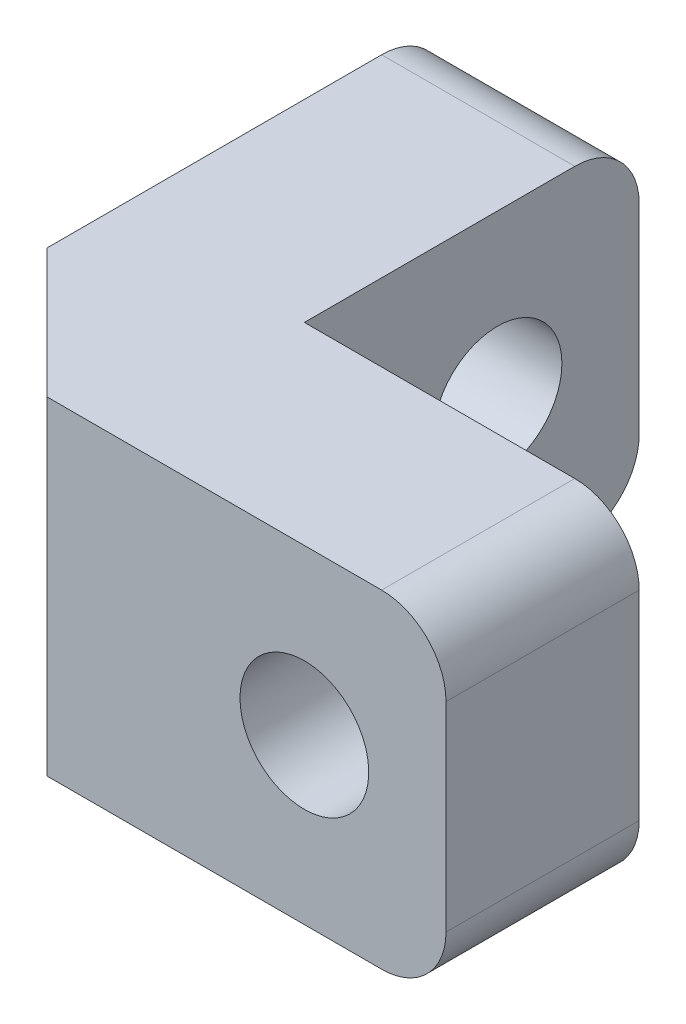
ISO-10303-21;
HEADER;
FILE_DESCRIPTION(('STEP AP214'),'2;1');
FILE_NAME('part.step','',(''),(''),'','','');
FILE_SCHEMA(('AUTOMOTIVE_DESIGN { 1 0 10303 214 1 1 1 1 }'));
ENDSEC;
DATA;
#1=APPLICATION_CONTEXT('core data for automotive mechanical design processes');
#2=APPLICATION_PROTOCOL_DEFINITION('international standard','automotive_design',2000,#1);
#3=PRODUCT_CONTEXT('',#1,'mechanical');
#4=PRODUCT('Part','Part','',(#3));
#5=PRODUCT_RELATED_PRODUCT_CATEGORY('part','',(#4));
#6=PRODUCT_DEFINITION_FORMATION('','',#4);
#7=PRODUCT_DEFINITION_CONTEXT('part definition',#1,'design');
#8=PRODUCT_DEFINITION('design','',#6,#7);
#9=PRODUCT_DEFINITION_SHAPE('','',#8);
#10=(LENGTH_UNIT() NAMED_UNIT(*) SI_UNIT(.MILLI.,.METRE.));
#11=(NAMED_UNIT(*) PLANE_ANGLE_UNIT() SI_UNIT($,.RADIAN.));
#12=(NAMED_UNIT(*) SI_UNIT($,.STERADIAN.) SOLID_ANGLE_UNIT());
#13=UNCERTAINTY_MEASURE_WITH_UNIT(LENGTH_MEASURE(1.E-05),#10,'distance_accuracy_value','');
#14=(GEOMETRIC_REPRESENTATION_CONTEXT(3) GLOBAL_UNCERTAINTY_ASSIGNED_CONTEXT((#13)) GLOBAL_UNIT_ASSIGNED_CONTEXT((#10,
#11,#12)) REPRESENTATION_CONTEXT('',''));
#15=CARTESIAN_POINT('',(0.,0.,0.));
#16=DIRECTION('',(0.,0.,1.));
#17=DIRECTION('',(1.,0.,0.));
#18=AXIS2_PLACEMENT_3D('',#15,#16,#17);
#19=CARTESIAN_POINT('',(-5.1,2.55,-3.));
#20=DIRECTION('',(1.,0.,0.));
#21=DIRECTION('',(0.,0.,-1.));
#22=AXIS2_PLACEMENT_3D('',#19,#20,#21);
#23=CYLINDRICAL_SURFACE('',#22,1.);
#24=CARTESIAN_POINT('',(0.,2.55,-3.));
#25=DIRECTION('',(1.,0.,0.));
#26=DIRECTION('',(0.,0.,-1.));
#27=AXIS2_PLACEMENT_3D('',#24,#25,#26);
#28=CIRCLE('',#27,1.);
#29=CARTESIAN_POINT('',(0.,2.55,-4.));
#30=VERTEX_POINT('',#29);
#31=EDGE_CURVE('E192',#30,#30,#28,.T.);
#32=ORIENTED_EDGE('',*,*,#31,.T.);
#33=EDGE_LOOP('',(#32));
#34=FACE_BOUND('',#33,.T.);
#35=CARTESIAN_POINT('',(-1.6,2.55,-3.));
#36=DIRECTION('',(-1.,0.,0.));
#37=DIRECTION('',(0.,0.,1.));
#38=AXIS2_PLACEMENT_3D('',#35,#36,#37);
#39=CIRCLE('',#38,1.);
#40=CARTESIAN_POINT('',(-1.6,2.55,-2.));
#41=VERTEX_POINT('',#40);
#42=EDGE_CURVE('E38',#41,#41,#39,.F.);
#43=ORIENTED_EDGE('',*,*,#42,.F.);
#44=EDGE_LOOP('',(#43));
#45=FACE_BOUND('',#44,.T.);
#46=ADVANCED_FACE('F34',(#34,#45),#23,.F.);
#47=CARTESIAN_POINT('',(3.,2.55,5.1));
#48=DIRECTION('',(0.,0.,-1.));
#49=DIRECTION('',(-1.,0.,0.));
#50=AXIS2_PLACEMENT_3D('',#47,#48,#49);
#51=CYLINDRICAL_SURFACE('',#50,1.);
#52=CARTESIAN_POINT('',(3.,2.55,3.));
#53=DIRECTION('',(0.,0.,-1.));
#54=DIRECTION('',(-1.,0.,0.));
#55=AXIS2_PLACEMENT_3D('',#52,#53,#54);
#56=CIRCLE('',#55,1.);
#57=CARTESIAN_POINT('',(2.,2.55,3.));
#58=VERTEX_POINT('',#57);
#59=EDGE_CURVE('E190',#58,#58,#56,.T.);
#60=ORIENTED_EDGE('',*,*,#59,.F.);
#61=EDGE_LOOP('',(#60));
#62=FACE_BOUND('',#61,.T.);
#63=CARTESIAN_POINT('',(3.,2.55,1.4));
#64=DIRECTION('',(0.,0.,-1.));
#65=DIRECTION('',(-1.,0.,0.));
#66=AXIS2_PLACEMENT_3D('',#63,#64,#65);
#67=CIRCLE('',#66,1.);
#68=CARTESIAN_POINT('',(2.,2.55,1.4));
#69=VERTEX_POINT('',#68);
#70=EDGE_CURVE('E193',#69,#69,#67,.F.);
#71=ORIENTED_EDGE('',*,*,#70,.F.);
#72=EDGE_LOOP('',(#71));
#73=FACE_BOUND('',#72,.T.);
#74=ADVANCED_FACE('F268',(#62,#73),#51,.F.);
#75=CARTESIAN_POINT('',(0.,5.1,0.));
#76=DIRECTION('',(0.,0.,1.));
#77=DIRECTION('',(1.,0.,0.));
#78=AXIS2_PLACEMENT_3D('',#75,#76,#77);
#79=PLANE('',#78);
#80=CARTESIAN_POINT('',(3.,2.55,0.));
#81=DIRECTION('',(0.,0.,-1.));
#82=DIRECTION('',(-1.,0.,0.));
#83=AXIS2_PLACEMENT_3D('',#80,#81,#82);
#84=CIRCLE('',#83,1.7);
#85=CARTESIAN_POINT('',(1.3,2.55,0.));
#86=VERTEX_POINT('',#85);
#87=EDGE_CURVE('E199',#86,#86,#84,.T.);
#88=ORIENTED_EDGE('',*,*,#87,.F.);
#89=EDGE_LOOP('',(#88));
#90=FACE_BOUND('',#89,.T.);
#91=DIRECTION('',(0.,-1.,0.));
#92=VECTOR('',#91,1.);
#93=CARTESIAN_POINT('',(5.2,5.1,0.));
#94=LINE('',#93,#92);
#95=CARTESIAN_POINT('',(5.2,4.1,0.));
#96=VERTEX_POINT('',#95);
#97=CARTESIAN_POINT('',(5.2,1.,0.));
#98=VERTEX_POINT('',#97);
#99=EDGE_CURVE('E214',#96,#98,#94,.T.);
#100=ORIENTED_EDGE('',*,*,#99,.T.);
#101=CARTESIAN_POINT('',(4.2,1.,0.));
#102=DIRECTION('',(0.,0.,1.));
#103=DIRECTION('',(1.,0.,0.));
#104=AXIS2_PLACEMENT_3D('',#101,#102,#103);
#105=CIRCLE('',#104,1.);
#106=CARTESIAN_POINT('',(4.2,0.,0.));
#107=VERTEX_POINT('',#106);
#108=EDGE_CURVE('E168',#98,#107,#105,.F.);
#109=ORIENTED_EDGE('',*,*,#108,.T.);
#110=DIRECTION('',(-1.,0.,0.));
#111=VECTOR('',#110,1.);
#112=CARTESIAN_POINT('',(0.,0.,0.));
#113=LINE('',#112,#111);
#114=CARTESIAN_POINT('',(0.,0.,0.));
#115=VERTEX_POINT('',#114);
#116=EDGE_CURVE('E142',#107,#115,#113,.T.);
#117=ORIENTED_EDGE('',*,*,#116,.T.);
#118=DIRECTION('',(0.,-1.,0.));
#119=VECTOR('',#118,1.);
#120=CARTESIAN_POINT('',(0.,5.1,0.));
#121=LINE('',#120,#119);
#122=CARTESIAN_POINT('',(0.,5.1,0.));
#123=VERTEX_POINT('',#122);
#124=EDGE_CURVE('E135',#123,#115,#121,.T.);
#125=ORIENTED_EDGE('',*,*,#124,.F.);
#126=DIRECTION('',(-1.,0.,0.));
#127=VECTOR('',#126,1.);
#128=CARTESIAN_POINT('',(0.,5.1,0.));
#129=LINE('',#128,#127);
#130=CARTESIAN_POINT('',(4.2,5.1,0.));
#131=VERTEX_POINT('',#130);
#132=EDGE_CURVE('E120',#131,#123,#129,.T.);
#133=ORIENTED_EDGE('',*,*,#132,.F.);
#134=CARTESIAN_POINT('',(4.2,4.1,0.));
#135=DIRECTION('',(0.,0.,1.));
#136=DIRECTION('',(1.,0.,0.));
#137=AXIS2_PLACEMENT_3D('',#134,#135,#136);
#138=CIRCLE('',#137,1.);
#139=EDGE_CURVE('E166',#131,#96,#138,.F.);
#140=ORIENTED_EDGE('',*,*,#139,.T.);
#141=EDGE_LOOP('',(#100,#109,#117,#125,#133,#140));
#142=FACE_BOUND('',#141,.T.);
#143=ADVANCED_FACE('F140',(#90,#142),#79,.F.);
#144=CARTESIAN_POINT('',(0.,5.1,0.));
#145=DIRECTION('',(-1.,0.,0.));
#146=DIRECTION('',(0.,0.,1.));
#147=AXIS2_PLACEMENT_3D('',#144,#145,#146);
#148=PLANE('',#147);
#149=ORIENTED_EDGE('',*,*,#31,.F.);
#150=EDGE_LOOP('',(#149));
#151=FACE_BOUND('',#150,.T.);
#152=DIRECTION('',(0.,0.,-1.));
#153=VECTOR('',#152,1.);
#154=CARTESIAN_POINT('',(0.,0.,0.));
#155=LINE('',#154,#153);
#156=CARTESIAN_POINT('',(0.,0.,-4.2));
#157=VERTEX_POINT('',#156);
#158=EDGE_CURVE('E216',#115,#157,#155,.T.);
#159=ORIENTED_EDGE('',*,*,#158,.T.);
#160=CARTESIAN_POINT('',(0.,1.,-4.2));
#161=DIRECTION('',(-1.,0.,0.));
#162=DIRECTION('',(0.,0.,1.));
#163=AXIS2_PLACEMENT_3D('',#160,#161,#162);
#164=CIRCLE('',#163,1.);
#165=CARTESIAN_POINT('',(0.,1.,-5.2));
#166=VERTEX_POINT('',#165);
#167=EDGE_CURVE('E11',#157,#166,#164,.F.);
#168=ORIENTED_EDGE('',*,*,#167,.T.);
#169=DIRECTION('',(0.,-1.,0.));
#170=VECTOR('',#169,1.);
#171=CARTESIAN_POINT('',(0.,5.1,-5.2));
#172=LINE('',#171,#170);
#173=CARTESIAN_POINT('',(0.,4.1,-5.2));
#174=VERTEX_POINT('',#173);
#175=EDGE_CURVE('E145',#174,#166,#172,.T.);
#176=ORIENTED_EDGE('',*,*,#175,.F.);
#177=CARTESIAN_POINT('',(0.,4.1,-4.2));
#178=DIRECTION('',(-1.,0.,0.));
#179=DIRECTION('',(0.,0.,1.));
#180=AXIS2_PLACEMENT_3D('',#177,#178,#179);
#181=CIRCLE('',#180,1.);
#182=CARTESIAN_POINT('',(0.,5.1,-4.2));
#183=VERTEX_POINT('',#182);
#184=EDGE_CURVE('E43',#174,#183,#181,.F.);
#185=ORIENTED_EDGE('',*,*,#184,.T.);
#186=DIRECTION('',(0.,0.,-1.));
#187=VECTOR('',#186,1.);
#188=CARTESIAN_POINT('',(0.,5.1,0.));
#189=LINE('',#188,#187);
#190=EDGE_CURVE('E125',#123,#183,#189,.T.);
#191=ORIENTED_EDGE('',*,*,#190,.F.);
#192=ORIENTED_EDGE('',*,*,#124,.T.);
#193=EDGE_LOOP('',(#159,#168,#176,#185,#191,#192));
#194=FACE_BOUND('',#193,.T.);
#195=ADVANCED_FACE('F134',(#151,#194),#148,.F.);
#196=CARTESIAN_POINT('',(0.,5.1,-5.2));
#197=DIRECTION('',(0.,0.,1.));
#198=DIRECTION('',(1.,0.,0.));
#199=AXIS2_PLACEMENT_3D('',#196,#197,#198);
#200=PLANE('',#199);
#201=ORIENTED_EDGE('',*,*,#175,.T.);
#202=DIRECTION('',(-1.,0.,0.));
#203=VECTOR('',#202,1.);
#204=CARTESIAN_POINT('',(0.,1.,-5.2));
#205=LINE('',#204,#203);
#206=CARTESIAN_POINT('',(-3.,1.,-5.2));
#207=VERTEX_POINT('',#206);
#208=EDGE_CURVE('E182',#166,#207,#205,.T.);
#209=ORIENTED_EDGE('',*,*,#208,.T.);
#210=DIRECTION('',(0.,-1.,0.));
#211=VECTOR('',#210,1.);
#212=CARTESIAN_POINT('',(-3.,5.1,-5.2));
#213=LINE('',#212,#211);
#214=CARTESIAN_POINT('',(-3.,4.1,-5.2));
#215=VERTEX_POINT('',#214);
#216=EDGE_CURVE('E150',#215,#207,#213,.T.);
#217=ORIENTED_EDGE('',*,*,#216,.F.);
#218=DIRECTION('',(-1.,0.,0.));
#219=VECTOR('',#218,1.);
#220=CARTESIAN_POINT('',(0.,4.1,-5.2));
#221=LINE('',#220,#219);
#222=EDGE_CURVE('E56',#215,#174,#221,.F.);
#223=ORIENTED_EDGE('',*,*,#222,.T.);
#224=EDGE_LOOP('',(#201,#209,#217,#223));
#225=FACE_BOUND('',#224,.T.);
#226=ADVANCED_FACE('F230',(#225),#200,.F.);
#227=CARTESIAN_POINT('',(-3.,5.1,-5.2));
#228=DIRECTION('',(1.,0.,0.));
#229=DIRECTION('',(0.,0.,-1.));
#230=AXIS2_PLACEMENT_3D('',#227,#228,#229);
#231=PLANE('',#230);
#232=CARTESIAN_POINT('',(-3.,2.55,-3.));
#233=DIRECTION('',(-1.,0.,0.));
#234=DIRECTION('',(0.,0.,1.));
#235=AXIS2_PLACEMENT_3D('',#232,#233,#234);
#236=CIRCLE('',#235,1.7);
#237=CARTESIAN_POINT('',(-3.,2.55,-1.3));
#238=VERTEX_POINT('',#237);
#239=EDGE_CURVE('E206',#238,#238,#236,.T.);
#240=ORIENTED_EDGE('',*,*,#239,.F.);
#241=EDGE_LOOP('',(#240));
#242=FACE_BOUND('',#241,.T.);
#243=ORIENTED_EDGE('',*,*,#216,.T.);
#244=CARTESIAN_POINT('',(-3.,1.,-4.2));
#245=DIRECTION('',(1.,0.,0.));
#246=DIRECTION('',(0.,0.,-1.));
#247=AXIS2_PLACEMENT_3D('',#244,#245,#246);
#248=CIRCLE('',#247,1.);
#249=CARTESIAN_POINT('',(-3.,0.,-4.2));
#250=VERTEX_POINT('',#249);
#251=EDGE_CURVE('E187',#207,#250,#248,.F.);
#252=ORIENTED_EDGE('',*,*,#251,.T.);
#253=DIRECTION('',(0.,0.,1.));
#254=VECTOR('',#253,1.);
#255=CARTESIAN_POINT('',(-3.,0.,-5.2));
#256=LINE('',#255,#254);
#257=CARTESIAN_POINT('',(-3.,0.,0.999999999999991));
#258=VERTEX_POINT('',#257);
#259=EDGE_CURVE('E218',#250,#258,#256,.T.);
#260=ORIENTED_EDGE('',*,*,#259,.T.);
#261=DIRECTION('',(0.,1.,0.));
#262=VECTOR('',#261,1.);
#263=CARTESIAN_POINT('',(-3.,5.1,0.999999999999991));
#264=LINE('',#263,#262);
#265=CARTESIAN_POINT('',(-3.,5.1,0.99999999999999));
#266=VERTEX_POINT('',#265);
#267=EDGE_CURVE('E156',#258,#266,#264,.T.);
#268=ORIENTED_EDGE('',*,*,#267,.T.);
#269=DIRECTION('',(0.,0.,1.));
#270=VECTOR('',#269,1.);
#271=CARTESIAN_POINT('',(-3.,5.1,-5.2));
#272=LINE('',#271,#270);
#273=CARTESIAN_POINT('',(-3.,5.1,-4.2));
#274=VERTEX_POINT('',#273);
#275=EDGE_CURVE('E137',#274,#266,#272,.T.);
#276=ORIENTED_EDGE('',*,*,#275,.F.);
#277=CARTESIAN_POINT('',(-3.,4.1,-4.2));
#278=DIRECTION('',(1.,0.,0.));
#279=DIRECTION('',(0.,0.,-1.));
#280=AXIS2_PLACEMENT_3D('',#277,#278,#279);
#281=CIRCLE('',#280,1.);
#282=EDGE_CURVE('E185',#274,#215,#281,.F.);
#283=ORIENTED_EDGE('',*,*,#282,.T.);
#284=EDGE_LOOP('',(#243,#252,#260,#268,#276,#283));
#285=FACE_BOUND('',#284,.T.);
#286=ADVANCED_FACE('F227',(#242,#285),#231,.F.);
#287=CARTESIAN_POINT('',(-3.,5.1,3.));
#288=DIRECTION('',(0.,0.,-1.));
#289=DIRECTION('',(-1.,0.,0.));
#290=AXIS2_PLACEMENT_3D('',#287,#288,#289);
#291=PLANE('',#290);
#292=ORIENTED_EDGE('',*,*,#59,.T.);
#293=EDGE_LOOP('',(#292));
#294=FACE_BOUND('',#293,.T.);
#295=DIRECTION('',(1.,0.,0.));
#296=VECTOR('',#295,1.);
#297=CARTESIAN_POINT('',(-3.,0.,3.));
#298=LINE('',#297,#296);
#299=CARTESIAN_POINT('',(-0.999999999999998,0.,3.));
#300=VERTEX_POINT('',#299);
#301=CARTESIAN_POINT('',(4.2,0.,3.));
#302=VERTEX_POINT('',#301);
#303=EDGE_CURVE('E131',#300,#302,#298,.T.);
#304=ORIENTED_EDGE('',*,*,#303,.T.);
#305=CARTESIAN_POINT('',(4.2,1.,3.));
#306=DIRECTION('',(0.,0.,-1.));
#307=DIRECTION('',(-1.,0.,0.));
#308=AXIS2_PLACEMENT_3D('',#305,#306,#307);
#309=CIRCLE('',#308,1.);
#310=CARTESIAN_POINT('',(5.2,1.,3.));
#311=VERTEX_POINT('',#310);
#312=EDGE_CURVE('E176',#302,#311,#309,.F.);
#313=ORIENTED_EDGE('',*,*,#312,.T.);
#314=DIRECTION('',(0.,-1.,0.));
#315=VECTOR('',#314,1.);
#316=CARTESIAN_POINT('',(5.2,5.1,3.));
#317=LINE('',#316,#315);
#318=CARTESIAN_POINT('',(5.2,4.1,3.));
#319=VERTEX_POINT('',#318);
#320=EDGE_CURVE('E223',#319,#311,#317,.T.);
#321=ORIENTED_EDGE('',*,*,#320,.F.);
#322=CARTESIAN_POINT('',(4.2,4.1,3.));
#323=DIRECTION('',(0.,0.,-1.));
#324=DIRECTION('',(-1.,0.,0.));
#325=AXIS2_PLACEMENT_3D('',#322,#323,#324);
#326=CIRCLE('',#325,1.);
#327=CARTESIAN_POINT('',(4.2,5.1,3.));
#328=VERTEX_POINT('',#327);
#329=EDGE_CURVE('E174',#319,#328,#326,.F.);
#330=ORIENTED_EDGE('',*,*,#329,.T.);
#331=DIRECTION('',(1.,0.,0.));
#332=VECTOR('',#331,1.);
#333=CARTESIAN_POINT('',(-3.,5.1,3.));
#334=LINE('',#333,#332);
#335=CARTESIAN_POINT('',(-0.999999999999998,5.1,3.));
#336=VERTEX_POINT('',#335);
#337=EDGE_CURVE('E212',#336,#328,#334,.T.);
#338=ORIENTED_EDGE('',*,*,#337,.F.);
#339=DIRECTION('',(0.,-1.,0.));
#340=VECTOR('',#339,1.);
#341=CARTESIAN_POINT('',(-0.999999999999998,5.1,3.));
#342=LINE('',#341,#340);
#343=EDGE_CURVE('E144',#336,#300,#342,.T.);
#344=ORIENTED_EDGE('',*,*,#343,.T.);
#345=EDGE_LOOP('',(#304,#313,#321,#330,#338,#344));
#346=FACE_BOUND('',#345,.T.);
#347=ADVANCED_FACE('F240',(#294,#346),#291,.F.);
#348=CARTESIAN_POINT('',(5.2,5.1,3.));
#349=DIRECTION('',(-1.,0.,0.));
#350=DIRECTION('',(0.,0.,1.));
#351=AXIS2_PLACEMENT_3D('',#348,#349,#350);
#352=PLANE('',#351);
#353=ORIENTED_EDGE('',*,*,#320,.T.);
#354=DIRECTION('',(0.,0.,-1.));
#355=VECTOR('',#354,1.);
#356=CARTESIAN_POINT('',(5.2,1.,3.));
#357=LINE('',#356,#355);
#358=EDGE_CURVE('E163',#311,#98,#357,.T.);
#359=ORIENTED_EDGE('',*,*,#358,.T.);
#360=ORIENTED_EDGE('',*,*,#99,.F.);
#361=DIRECTION('',(0.,0.,-1.));
#362=VECTOR('',#361,1.);
#363=CARTESIAN_POINT('',(5.2,4.1,3.));
#364=LINE('',#363,#362);
#365=EDGE_CURVE('E161',#96,#319,#364,.F.);
#366=ORIENTED_EDGE('',*,*,#365,.T.);
#367=EDGE_LOOP('',(#353,#359,#360,#366));
#368=FACE_BOUND('',#367,.T.);
#369=ADVANCED_FACE('F249',(#368),#352,.F.);
#370=CARTESIAN_POINT('',(0.,5.1,0.));
#371=DIRECTION('',(0.,1.,0.));
#372=DIRECTION('',(0.,0.,1.));
#373=AXIS2_PLACEMENT_3D('',#370,#371,#372);
#374=PLANE('',#373);
#375=ORIENTED_EDGE('',*,*,#337,.T.);
#376=DIRECTION('',(0.,0.,-1.));
#377=VECTOR('',#376,1.);
#378=CARTESIAN_POINT('',(4.2,5.1,0.));
#379=LINE('',#378,#377);
#380=EDGE_CURVE('E128',#328,#131,#379,.T.);
#381=ORIENTED_EDGE('',*,*,#380,.T.);
#382=ORIENTED_EDGE('',*,*,#132,.T.);
#383=ORIENTED_EDGE('',*,*,#190,.T.);
#384=DIRECTION('',(-1.,0.,0.));
#385=VECTOR('',#384,1.);
#386=CARTESIAN_POINT('',(-3.,5.1,-4.2));
#387=LINE('',#386,#385);
#388=EDGE_CURVE('E178',#183,#274,#387,.T.);
#389=ORIENTED_EDGE('',*,*,#388,.T.);
#390=ORIENTED_EDGE('',*,*,#275,.T.);
#391=DIRECTION('',(-0.707106781186546,0.,-0.707106781186549));
#392=VECTOR('',#391,1.);
#393=CARTESIAN_POINT('',(-2.,5.1,1.99999999999999));
#394=LINE('',#393,#392);
#395=EDGE_CURVE('E159',#266,#336,#394,.F.);
#396=ORIENTED_EDGE('',*,*,#395,.T.);
#397=EDGE_LOOP('',(#375,#381,#382,#383,#389,#390,#396));
#398=FACE_BOUND('',#397,.T.);
#399=ADVANCED_FACE('F123',(#398),#374,.T.);
#400=CARTESIAN_POINT('',(0.,0.,0.));
#401=DIRECTION('',(0.,1.,0.));
#402=DIRECTION('',(0.,0.,1.));
#403=AXIS2_PLACEMENT_3D('',#400,#401,#402);
#404=PLANE('',#403);
#405=ORIENTED_EDGE('',*,*,#116,.F.);
#406=DIRECTION('',(0.,0.,-1.));
#407=VECTOR('',#406,1.);
#408=CARTESIAN_POINT('',(4.2,0.,0.));
#409=LINE('',#408,#407);
#410=EDGE_CURVE('E172',#107,#302,#409,.F.);
#411=ORIENTED_EDGE('',*,*,#410,.T.);
#412=ORIENTED_EDGE('',*,*,#303,.F.);
#413=DIRECTION('',(0.707106781186546,0.,0.707106781186549));
#414=VECTOR('',#413,1.);
#415=CARTESIAN_POINT('',(-0.999999999999998,0.,3.));
#416=LINE('',#415,#414);
#417=EDGE_CURVE('E148',#300,#258,#416,.F.);
#418=ORIENTED_EDGE('',*,*,#417,.T.);
#419=ORIENTED_EDGE('',*,*,#259,.F.);
#420=DIRECTION('',(-1.,0.,0.));
#421=VECTOR('',#420,1.);
#422=CARTESIAN_POINT('',(0.,0.,-4.2));
#423=LINE('',#422,#421);
#424=EDGE_CURVE('E170',#250,#157,#423,.F.);
#425=ORIENTED_EDGE('',*,*,#424,.T.);
#426=ORIENTED_EDGE('',*,*,#158,.F.);
#427=EDGE_LOOP('',(#405,#411,#412,#418,#419,#425,#426));
#428=FACE_BOUND('',#427,.T.);
#429=ADVANCED_FACE('F256',(#428),#404,.F.);
#430=CARTESIAN_POINT('',(-0.999999999999998,5.1,3.));
#431=DIRECTION('',(0.707106781186549,0.,-0.707106781186546));
#432=DIRECTION('',(0.,-1.,0.));
#433=AXIS2_PLACEMENT_3D('',#430,#431,#432);
#434=PLANE('',#433);
#435=ORIENTED_EDGE('',*,*,#395,.F.);
#436=ORIENTED_EDGE('',*,*,#267,.F.);
#437=ORIENTED_EDGE('',*,*,#417,.F.);
#438=ORIENTED_EDGE('',*,*,#343,.F.);
#439=EDGE_LOOP('',(#435,#436,#437,#438));
#440=FACE_BOUND('',#439,.T.);
#441=ADVANCED_FACE('F237',(#440),#434,.F.);
#442=CARTESIAN_POINT('',(4.2,1.,3.));
#443=DIRECTION('',(0.,0.,-1.));
#444=DIRECTION('',(-1.,0.,0.));
#445=AXIS2_PLACEMENT_3D('',#442,#443,#444);
#446=CYLINDRICAL_SURFACE('',#445,1.);
#447=ORIENTED_EDGE('',*,*,#312,.F.);
#448=ORIENTED_EDGE('',*,*,#410,.F.);
#449=ORIENTED_EDGE('',*,*,#108,.F.);
#450=ORIENTED_EDGE('',*,*,#358,.F.);
#451=EDGE_LOOP('',(#447,#448,#449,#450));
#452=FACE_BOUND('',#451,.T.);
#453=ADVANCED_FACE('F253',(#452),#446,.T.);
#454=CARTESIAN_POINT('',(4.2,4.1,0.));
#455=DIRECTION('',(0.,0.,1.));
#456=DIRECTION('',(1.,0.,0.));
#457=AXIS2_PLACEMENT_3D('',#454,#455,#456);
#458=CYLINDRICAL_SURFACE('',#457,1.);
#459=ORIENTED_EDGE('',*,*,#329,.F.);
#460=ORIENTED_EDGE('',*,*,#365,.F.);
#461=ORIENTED_EDGE('',*,*,#139,.F.);
#462=ORIENTED_EDGE('',*,*,#380,.F.);
#463=EDGE_LOOP('',(#459,#460,#461,#462));
#464=FACE_BOUND('',#463,.T.);
#465=ADVANCED_FACE('F246',(#464),#458,.T.);
#466=CARTESIAN_POINT('',(0.,1.,-4.2));
#467=DIRECTION('',(-1.,0.,0.));
#468=DIRECTION('',(0.,0.,1.));
#469=AXIS2_PLACEMENT_3D('',#466,#467,#468);
#470=CYLINDRICAL_SURFACE('',#469,1.);
#471=ORIENTED_EDGE('',*,*,#167,.F.);
#472=ORIENTED_EDGE('',*,*,#424,.F.);
#473=ORIENTED_EDGE('',*,*,#251,.F.);
#474=ORIENTED_EDGE('',*,*,#208,.F.);
#475=EDGE_LOOP('',(#471,#472,#473,#474));
#476=FACE_BOUND('',#475,.T.);
#477=ADVANCED_FACE('F259',(#476),#470,.T.);
#478=CARTESIAN_POINT('',(0.,4.1,-4.2));
#479=DIRECTION('',(1.,0.,0.));
#480=DIRECTION('',(0.,0.,-1.));
#481=AXIS2_PLACEMENT_3D('',#478,#479,#480);
#482=CYLINDRICAL_SURFACE('',#481,1.);
#483=ORIENTED_EDGE('',*,*,#184,.F.);
#484=ORIENTED_EDGE('',*,*,#222,.F.);
#485=ORIENTED_EDGE('',*,*,#282,.F.);
#486=ORIENTED_EDGE('',*,*,#388,.F.);
#487=EDGE_LOOP('',(#483,#484,#485,#486));
#488=FACE_BOUND('',#487,.T.);
#489=ADVANCED_FACE('F36',(#488),#482,.T.);
#490=CARTESIAN_POINT('',(3.,2.55,1.4));
#491=DIRECTION('',(0.,0.,-1.));
#492=DIRECTION('',(-1.,0.,0.));
#493=AXIS2_PLACEMENT_3D('',#490,#491,#492);
#494=PLANE('',#493);
#495=CARTESIAN_POINT('',(3.,2.55,1.4));
#496=DIRECTION('',(0.,0.,-1.));
#497=DIRECTION('',(-1.,0.,0.));
#498=AXIS2_PLACEMENT_3D('',#495,#496,#497);
#499=CIRCLE('',#498,1.7);
#500=CARTESIAN_POINT('',(1.3,2.55,1.4));
#501=VERTEX_POINT('',#500);
#502=EDGE_CURVE('E195',#501,#501,#499,.T.);
#503=ORIENTED_EDGE('',*,*,#502,.T.);
#504=EDGE_LOOP('',(#503));
#505=FACE_BOUND('',#504,.T.);
#506=ORIENTED_EDGE('',*,*,#70,.T.);
#507=EDGE_LOOP('',(#506));
#508=FACE_BOUND('',#507,.T.);
#509=ADVANCED_FACE('F265',(#505,#508),#494,.T.);
#510=CARTESIAN_POINT('',(3.,2.55,1.4));
#511=DIRECTION('',(0.,0.,-1.));
#512=DIRECTION('',(-1.,0.,0.));
#513=AXIS2_PLACEMENT_3D('',#510,#511,#512);
#514=CYLINDRICAL_SURFACE('',#513,1.7);
#515=ORIENTED_EDGE('',*,*,#502,.F.);
#516=EDGE_LOOP('',(#515));
#517=FACE_BOUND('',#516,.T.);
#518=ORIENTED_EDGE('',*,*,#87,.T.);
#519=EDGE_LOOP('',(#518));
#520=FACE_BOUND('',#519,.T.);
#521=ADVANCED_FACE('F357',(#517,#520),#514,.F.);
#522=CARTESIAN_POINT('',(-1.6,2.55,-3.));
#523=DIRECTION('',(-1.,0.,0.));
#524=DIRECTION('',(0.,0.,1.));
#525=AXIS2_PLACEMENT_3D('',#522,#523,#524);
#526=PLANE('',#525);
#527=CARTESIAN_POINT('',(-1.6,2.55,-3.));
#528=DIRECTION('',(-1.,0.,0.));
#529=DIRECTION('',(0.,0.,1.));
#530=AXIS2_PLACEMENT_3D('',#527,#528,#529);
#531=CIRCLE('',#530,1.7);
#532=CARTESIAN_POINT('',(-1.6,2.55,-1.3));
#533=VERTEX_POINT('',#532);
#534=EDGE_CURVE('E401',#533,#533,#531,.T.);
#535=ORIENTED_EDGE('',*,*,#534,.T.);
#536=EDGE_LOOP('',(#535));
#537=FACE_BOUND('',#536,.T.);
#538=ORIENTED_EDGE('',*,*,#42,.T.);
#539=EDGE_LOOP('',(#538));
#540=FACE_BOUND('',#539,.T.);
#541=ADVANCED_FACE('F365',(#537,#540),#526,.T.);
#542=CARTESIAN_POINT('',(-1.6,2.55,-3.));
#543=DIRECTION('',(-1.,0.,0.));
#544=DIRECTION('',(0.,0.,1.));
#545=AXIS2_PLACEMENT_3D('',#542,#543,#544);
#546=CYLINDRICAL_SURFACE('',#545,1.7);
#547=ORIENTED_EDGE('',*,*,#534,.F.);
#548=EDGE_LOOP('',(#547));
#549=FACE_BOUND('',#548,.T.);
#550=ORIENTED_EDGE('',*,*,#239,.T.);
#551=EDGE_LOOP('',(#550));
#552=FACE_BOUND('',#551,.T.);
#553=ADVANCED_FACE('F384',(#549,#552),#546,.F.);
#554=CLOSED_SHELL('',(#46,#74,#143,#195,#226,#286,#347,#369,#399,#429,#441,#453,#465,#477,#489,
#509,#521,#541,#553));
#555=MANIFOLD_SOLID_BREP('B2',#554);
#556=ADVANCED_BREP_SHAPE_REPRESENTATION('',(#18,#555),#14);
#557=SHAPE_DEFINITION_REPRESENTATION(#9,#556);
ENDSEC;
END-ISO-10303-21;
